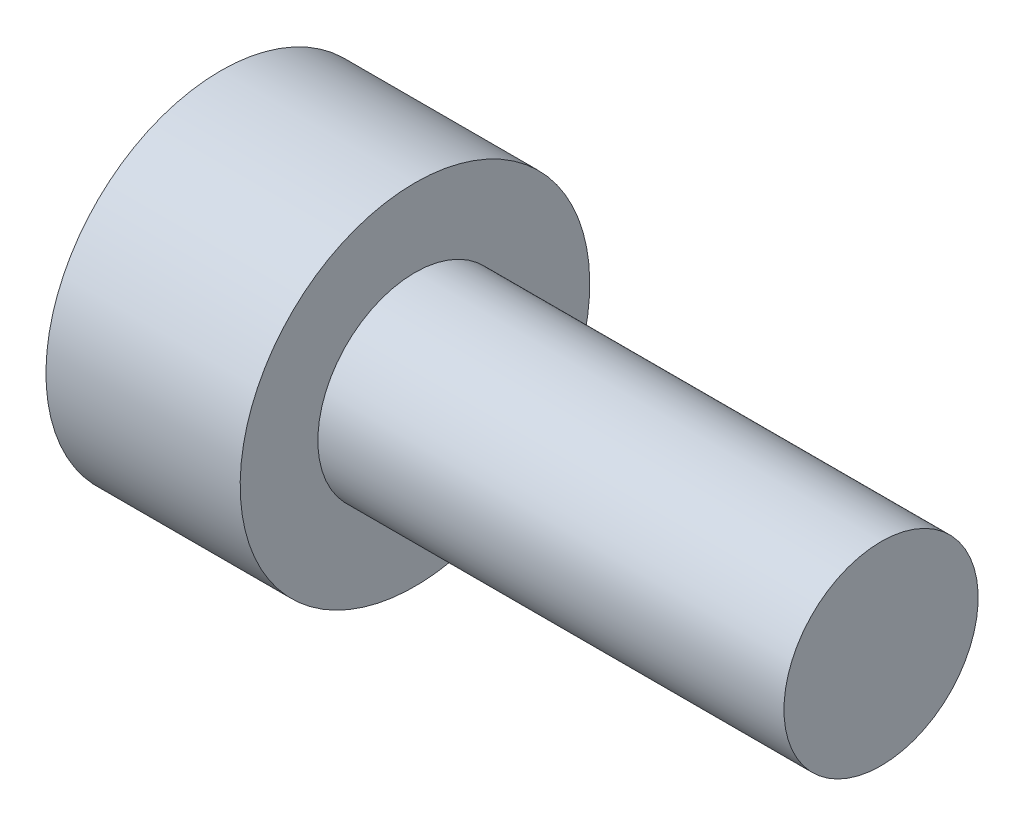
ISO-10303-21;
HEADER;
FILE_DESCRIPTION(('STEP AP214'),'2;1');
FILE_NAME('part.step','',(''),(''),'','','');
FILE_SCHEMA(('AUTOMOTIVE_DESIGN { 1 0 10303 214 1 1 1 1 }'));
ENDSEC;
DATA;
#1=APPLICATION_CONTEXT('core data for automotive mechanical design processes');
#2=APPLICATION_PROTOCOL_DEFINITION('international standard','automotive_design',2000,#1);
#3=PRODUCT_CONTEXT('',#1,'mechanical');
#4=PRODUCT('Part','Part','',(#3));
#5=PRODUCT_RELATED_PRODUCT_CATEGORY('part','',(#4));
#6=PRODUCT_DEFINITION_FORMATION('','',#4);
#7=PRODUCT_DEFINITION_CONTEXT('part definition',#1,'design');
#8=PRODUCT_DEFINITION('design','',#6,#7);
#9=PRODUCT_DEFINITION_SHAPE('','',#8);
#10=(LENGTH_UNIT() NAMED_UNIT(*) SI_UNIT(.MILLI.,.METRE.));
#11=(NAMED_UNIT(*) PLANE_ANGLE_UNIT() SI_UNIT($,.RADIAN.));
#12=(NAMED_UNIT(*) SI_UNIT($,.STERADIAN.) SOLID_ANGLE_UNIT());
#13=UNCERTAINTY_MEASURE_WITH_UNIT(LENGTH_MEASURE(1.E-05),#10,'distance_accuracy_value','');
#14=(GEOMETRIC_REPRESENTATION_CONTEXT(3) GLOBAL_UNCERTAINTY_ASSIGNED_CONTEXT((#13)) GLOBAL_UNIT_ASSIGNED_CONTEXT((#10,
#11,#12)) REPRESENTATION_CONTEXT('',''));
#15=CARTESIAN_POINT('',(0.,0.,0.));
#16=DIRECTION('',(0.,0.,1.));
#17=DIRECTION('',(1.,0.,0.));
#18=AXIS2_PLACEMENT_3D('',#15,#16,#17);
#19=CARTESIAN_POINT('',(0.,0.,0.));
#20=DIRECTION('',(-1.,0.,0.));
#21=DIRECTION('',(0.,-1.,0.));
#22=AXIS2_PLACEMENT_3D('',#19,#20,#21);
#23=PLANE('',#22);
#24=DIRECTION('',(0.,0.866025403784439,0.5));
#25=VECTOR('',#24,1.);
#26=CARTESIAN_POINT('',(0.,-1.,0.577350269189626));
#27=LINE('',#26,#25);
#28=CARTESIAN_POINT('',(0.,-1.,0.577350269189626));
#29=VERTEX_POINT('',#28);
#30=CARTESIAN_POINT('',(0.,0.,1.15470053837925));
#31=VERTEX_POINT('',#30);
#32=EDGE_CURVE('E47',#29,#31,#27,.T.);
#33=ORIENTED_EDGE('',*,*,#32,.F.);
#34=DIRECTION('',(0.,0.,1.));
#35=VECTOR('',#34,1.);
#36=CARTESIAN_POINT('',(0.,-1.,-0.577350269189626));
#37=LINE('',#36,#35);
#38=CARTESIAN_POINT('',(0.,-1.,-0.577350269189626));
#39=VERTEX_POINT('',#38);
#40=EDGE_CURVE('E130',#39,#29,#37,.T.);
#41=ORIENTED_EDGE('',*,*,#40,.F.);
#42=DIRECTION('',(0.,-0.866025403784439,0.5));
#43=VECTOR('',#42,1.);
#44=CARTESIAN_POINT('',(0.,0.,-1.15470053837925));
#45=LINE('',#44,#43);
#46=CARTESIAN_POINT('',(0.,0.,-1.15470053837925));
#47=VERTEX_POINT('',#46);
#48=EDGE_CURVE('E128',#47,#39,#45,.T.);
#49=ORIENTED_EDGE('',*,*,#48,.F.);
#50=DIRECTION('',(0.,-0.866025403784439,-0.5));
#51=VECTOR('',#50,1.);
#52=CARTESIAN_POINT('',(0.,1.,-0.577350269189626));
#53=LINE('',#52,#51);
#54=CARTESIAN_POINT('',(0.,1.,-0.577350269189626));
#55=VERTEX_POINT('',#54);
#56=EDGE_CURVE('E95',#55,#47,#53,.T.);
#57=ORIENTED_EDGE('',*,*,#56,.F.);
#58=DIRECTION('',(0.,0.,-1.));
#59=VECTOR('',#58,1.);
#60=CARTESIAN_POINT('',(0.,1.,0.577350269189625));
#61=LINE('',#60,#59);
#62=CARTESIAN_POINT('',(0.,1.,0.577350269189625));
#63=VERTEX_POINT('',#62);
#64=EDGE_CURVE('E124',#63,#55,#61,.T.);
#65=ORIENTED_EDGE('',*,*,#64,.F.);
#66=DIRECTION('',(0.,0.866025403784439,-0.5));
#67=VECTOR('',#66,1.);
#68=CARTESIAN_POINT('',(0.,0.,1.15470053837925));
#69=LINE('',#68,#67);
#70=EDGE_CURVE('E121',#31,#63,#69,.T.);
#71=ORIENTED_EDGE('',*,*,#70,.F.);
#72=EDGE_LOOP('',(#33,#41,#49,#57,#65,#71));
#73=FACE_BOUND('',#72,.T.);
#74=CARTESIAN_POINT('',(0.,0.,0.));
#75=DIRECTION('',(1.,0.,0.));
#76=DIRECTION('',(0.,1.,0.));
#77=AXIS2_PLACEMENT_3D('',#74,#75,#76);
#78=CIRCLE('',#77,2.25);
#79=CARTESIAN_POINT('',(0.,2.25,0.));
#80=VERTEX_POINT('',#79);
#81=EDGE_CURVE('E11',#80,#80,#78,.T.);
#82=ORIENTED_EDGE('',*,*,#81,.F.);
#83=EDGE_LOOP('',(#82));
#84=FACE_BOUND('',#83,.T.);
#85=ADVANCED_FACE('F33',(#73,#84),#23,.T.);
#86=CARTESIAN_POINT('',(8.5,0.,0.));
#87=DIRECTION('',(1.,0.,0.));
#88=DIRECTION('',(0.,1.,0.));
#89=AXIS2_PLACEMENT_3D('',#86,#87,#88);
#90=CYLINDRICAL_SURFACE('',#89,2.25);
#91=ORIENTED_EDGE('',*,*,#81,.T.);
#92=EDGE_LOOP('',(#91));
#93=FACE_BOUND('',#92,.T.);
#94=CARTESIAN_POINT('',(2.5,0.,0.));
#95=DIRECTION('',(1.,0.,0.));
#96=DIRECTION('',(0.,1.,0.));
#97=AXIS2_PLACEMENT_3D('',#94,#95,#96);
#98=CIRCLE('',#97,2.25);
#99=CARTESIAN_POINT('',(2.5,2.25,0.));
#100=VERTEX_POINT('',#99);
#101=EDGE_CURVE('E40',#100,#100,#98,.T.);
#102=ORIENTED_EDGE('',*,*,#101,.F.);
#103=EDGE_LOOP('',(#102));
#104=FACE_BOUND('',#103,.T.);
#105=ADVANCED_FACE('F150',(#93,#104),#90,.T.);
#106=CARTESIAN_POINT('',(2.5,2.25,0.));
#107=DIRECTION('',(1.,0.,0.));
#108=DIRECTION('',(0.,1.,0.));
#109=AXIS2_PLACEMENT_3D('',#106,#107,#108);
#110=PLANE('',#109);
#111=ORIENTED_EDGE('',*,*,#101,.T.);
#112=EDGE_LOOP('',(#111));
#113=FACE_BOUND('',#112,.T.);
#114=CARTESIAN_POINT('',(2.5,0.,0.));
#115=DIRECTION('',(1.,0.,0.));
#116=DIRECTION('',(0.,1.,0.));
#117=AXIS2_PLACEMENT_3D('',#114,#115,#116);
#118=CIRCLE('',#117,1.25);
#119=CARTESIAN_POINT('',(2.5,1.25,0.));
#120=VERTEX_POINT('',#119);
#121=EDGE_CURVE('E142',#120,#120,#118,.T.);
#122=ORIENTED_EDGE('',*,*,#121,.F.);
#123=EDGE_LOOP('',(#122));
#124=FACE_BOUND('',#123,.T.);
#125=ADVANCED_FACE('F147',(#113,#124),#110,.T.);
#126=CARTESIAN_POINT('',(8.5,0.,0.));
#127=DIRECTION('',(1.,0.,0.));
#128=DIRECTION('',(0.,1.,0.));
#129=AXIS2_PLACEMENT_3D('',#126,#127,#128);
#130=CYLINDRICAL_SURFACE('',#129,1.25);
#131=ORIENTED_EDGE('',*,*,#121,.T.);
#132=EDGE_LOOP('',(#131));
#133=FACE_BOUND('',#132,.T.);
#134=CARTESIAN_POINT('',(8.5,0.,0.));
#135=DIRECTION('',(1.,0.,0.));
#136=DIRECTION('',(0.,1.,0.));
#137=AXIS2_PLACEMENT_3D('',#134,#135,#136);
#138=CIRCLE('',#137,1.25);
#139=CARTESIAN_POINT('',(8.5,1.25,0.));
#140=VERTEX_POINT('',#139);
#141=EDGE_CURVE('E134',#140,#140,#138,.T.);
#142=ORIENTED_EDGE('',*,*,#141,.F.);
#143=EDGE_LOOP('',(#142));
#144=FACE_BOUND('',#143,.T.);
#145=ADVANCED_FACE('F157',(#133,#144),#130,.T.);
#146=CARTESIAN_POINT('',(8.5,1.25,0.));
#147=DIRECTION('',(1.,0.,0.));
#148=DIRECTION('',(0.,1.,0.));
#149=AXIS2_PLACEMENT_3D('',#146,#147,#148);
#150=PLANE('',#149);
#151=ORIENTED_EDGE('',*,*,#141,.T.);
#152=EDGE_LOOP('',(#151));
#153=FACE_BOUND('',#152,.T.);
#154=ADVANCED_FACE('F163',(#153),#150,.T.);
#155=CARTESIAN_POINT('',(1.5,-1.,0.577350269189626));
#156=DIRECTION('',(0.,-0.5,0.866025403784439));
#157=DIRECTION('',(0.,-0.866025403784439,-0.5));
#158=AXIS2_PLACEMENT_3D('',#155,#156,#157);
#159=PLANE('',#158);
#160=ORIENTED_EDGE('',*,*,#32,.T.);
#161=DIRECTION('',(-1.,0.,0.));
#162=VECTOR('',#161,1.);
#163=CARTESIAN_POINT('',(1.5,0.,1.15470053837925));
#164=LINE('',#163,#162);
#165=CARTESIAN_POINT('',(1.5,0.,1.15470053837925));
#166=VERTEX_POINT('',#165);
#167=EDGE_CURVE('E77',#166,#31,#164,.T.);
#168=ORIENTED_EDGE('',*,*,#167,.F.);
#169=DIRECTION('',(0.,0.866025403784439,0.5));
#170=VECTOR('',#169,1.);
#171=CARTESIAN_POINT('',(1.5,-1.,0.577350269189626));
#172=LINE('',#171,#170);
#173=CARTESIAN_POINT('',(1.5,-1.,0.577350269189626));
#174=VERTEX_POINT('',#173);
#175=EDGE_CURVE('E132',#174,#166,#172,.T.);
#176=ORIENTED_EDGE('',*,*,#175,.F.);
#177=DIRECTION('',(-1.,0.,0.));
#178=VECTOR('',#177,1.);
#179=CARTESIAN_POINT('',(1.5,-1.,0.577350269189626));
#180=LINE('',#179,#178);
#181=EDGE_CURVE('E55',#174,#29,#180,.T.);
#182=ORIENTED_EDGE('',*,*,#181,.T.);
#183=EDGE_LOOP('',(#160,#168,#176,#182));
#184=FACE_BOUND('',#183,.T.);
#185=ADVANCED_FACE('F167',(#184),#159,.F.);
#186=CARTESIAN_POINT('',(1.5,-1.,-0.577350269189626));
#187=DIRECTION('',(0.,-1.,0.));
#188=DIRECTION('',(0.,0.,-1.));
#189=AXIS2_PLACEMENT_3D('',#186,#187,#188);
#190=PLANE('',#189);
#191=ORIENTED_EDGE('',*,*,#40,.T.);
#192=ORIENTED_EDGE('',*,*,#181,.F.);
#193=DIRECTION('',(0.,0.,1.));
#194=VECTOR('',#193,1.);
#195=CARTESIAN_POINT('',(1.5,-1.,-0.577350269189626));
#196=LINE('',#195,#194);
#197=CARTESIAN_POINT('',(1.5,-1.,-0.577350269189626));
#198=VERTEX_POINT('',#197);
#199=EDGE_CURVE('E107',#198,#174,#196,.T.);
#200=ORIENTED_EDGE('',*,*,#199,.F.);
#201=DIRECTION('',(-1.,0.,0.));
#202=VECTOR('',#201,1.);
#203=CARTESIAN_POINT('',(1.5,-1.,-0.577350269189626));
#204=LINE('',#203,#202);
#205=EDGE_CURVE('E99',#198,#39,#204,.T.);
#206=ORIENTED_EDGE('',*,*,#205,.T.);
#207=EDGE_LOOP('',(#191,#192,#200,#206));
#208=FACE_BOUND('',#207,.T.);
#209=ADVANCED_FACE('F171',(#208),#190,.F.);
#210=CARTESIAN_POINT('',(1.5,0.,-1.15470053837925));
#211=DIRECTION('',(0.,-0.5,-0.866025403784439));
#212=DIRECTION('',(0.,0.866025403784439,-0.5));
#213=AXIS2_PLACEMENT_3D('',#210,#211,#212);
#214=PLANE('',#213);
#215=ORIENTED_EDGE('',*,*,#48,.T.);
#216=ORIENTED_EDGE('',*,*,#205,.F.);
#217=DIRECTION('',(0.,-0.866025403784439,0.5));
#218=VECTOR('',#217,1.);
#219=CARTESIAN_POINT('',(1.5,0.,-1.15470053837925));
#220=LINE('',#219,#218);
#221=CARTESIAN_POINT('',(1.5,0.,-1.15470053837925));
#222=VERTEX_POINT('',#221);
#223=EDGE_CURVE('E103',#222,#198,#220,.T.);
#224=ORIENTED_EDGE('',*,*,#223,.F.);
#225=DIRECTION('',(-1.,0.,0.));
#226=VECTOR('',#225,1.);
#227=CARTESIAN_POINT('',(1.5,0.,-1.15470053837925));
#228=LINE('',#227,#226);
#229=EDGE_CURVE('E88',#222,#47,#228,.T.);
#230=ORIENTED_EDGE('',*,*,#229,.T.);
#231=EDGE_LOOP('',(#215,#216,#224,#230));
#232=FACE_BOUND('',#231,.T.);
#233=ADVANCED_FACE('F104',(#232),#214,.F.);
#234=CARTESIAN_POINT('',(1.5,1.,-0.577350269189626));
#235=DIRECTION('',(0.,0.5,-0.866025403784439));
#236=DIRECTION('',(0.,0.866025403784439,0.5));
#237=AXIS2_PLACEMENT_3D('',#234,#235,#236);
#238=PLANE('',#237);
#239=ORIENTED_EDGE('',*,*,#56,.T.);
#240=ORIENTED_EDGE('',*,*,#229,.F.);
#241=DIRECTION('',(0.,-0.866025403784439,-0.5));
#242=VECTOR('',#241,1.);
#243=CARTESIAN_POINT('',(1.5,1.,-0.577350269189626));
#244=LINE('',#243,#242);
#245=CARTESIAN_POINT('',(1.5,1.,-0.577350269189626));
#246=VERTEX_POINT('',#245);
#247=EDGE_CURVE('E92',#246,#222,#244,.T.);
#248=ORIENTED_EDGE('',*,*,#247,.F.);
#249=DIRECTION('',(-1.,0.,0.));
#250=VECTOR('',#249,1.);
#251=CARTESIAN_POINT('',(1.5,1.,-0.577350269189626));
#252=LINE('',#251,#250);
#253=EDGE_CURVE('E100',#246,#55,#252,.T.);
#254=ORIENTED_EDGE('',*,*,#253,.T.);
#255=EDGE_LOOP('',(#239,#240,#248,#254));
#256=FACE_BOUND('',#255,.T.);
#257=ADVANCED_FACE('F90',(#256),#238,.F.);
#258=CARTESIAN_POINT('',(1.5,1.,0.577350269189625));
#259=DIRECTION('',(0.,1.,0.));
#260=DIRECTION('',(-1.,0.,0.));
#261=AXIS2_PLACEMENT_3D('',#258,#259,#260);
#262=PLANE('',#261);
#263=ORIENTED_EDGE('',*,*,#64,.T.);
#264=ORIENTED_EDGE('',*,*,#253,.F.);
#265=DIRECTION('',(0.,0.,-1.));
#266=VECTOR('',#265,1.);
#267=CARTESIAN_POINT('',(1.5,1.,0.577350269189625));
#268=LINE('',#267,#266);
#269=CARTESIAN_POINT('',(1.5,1.,0.577350269189625));
#270=VERTEX_POINT('',#269);
#271=EDGE_CURVE('E113',#270,#246,#268,.T.);
#272=ORIENTED_EDGE('',*,*,#271,.F.);
#273=DIRECTION('',(-1.,0.,0.));
#274=VECTOR('',#273,1.);
#275=CARTESIAN_POINT('',(1.5,1.,0.577350269189625));
#276=LINE('',#275,#274);
#277=EDGE_CURVE('E137',#270,#63,#276,.T.);
#278=ORIENTED_EDGE('',*,*,#277,.T.);
#279=EDGE_LOOP('',(#263,#264,#272,#278));
#280=FACE_BOUND('',#279,.T.);
#281=ADVANCED_FACE('F175',(#280),#262,.F.);
#282=CARTESIAN_POINT('',(1.5,0.,1.15470053837925));
#283=DIRECTION('',(0.,0.5,0.866025403784439));
#284=DIRECTION('',(0.,-0.866025403784439,0.5));
#285=AXIS2_PLACEMENT_3D('',#282,#283,#284);
#286=PLANE('',#285);
#287=ORIENTED_EDGE('',*,*,#70,.T.);
#288=ORIENTED_EDGE('',*,*,#277,.F.);
#289=DIRECTION('',(0.,0.866025403784439,-0.5));
#290=VECTOR('',#289,1.);
#291=CARTESIAN_POINT('',(1.5,0.,1.15470053837925));
#292=LINE('',#291,#290);
#293=EDGE_CURVE('E115',#166,#270,#292,.T.);
#294=ORIENTED_EDGE('',*,*,#293,.F.);
#295=ORIENTED_EDGE('',*,*,#167,.T.);
#296=EDGE_LOOP('',(#287,#288,#294,#295));
#297=FACE_BOUND('',#296,.T.);
#298=ADVANCED_FACE('F172',(#297),#286,.F.);
#299=CARTESIAN_POINT('',(1.5,0.,0.));
#300=DIRECTION('',(-1.,0.,0.));
#301=DIRECTION('',(0.,-1.,0.));
#302=AXIS2_PLACEMENT_3D('',#299,#300,#301);
#303=PLANE('',#302);
#304=ORIENTED_EDGE('',*,*,#175,.T.);
#305=ORIENTED_EDGE('',*,*,#293,.T.);
#306=ORIENTED_EDGE('',*,*,#271,.T.);
#307=ORIENTED_EDGE('',*,*,#247,.T.);
#308=ORIENTED_EDGE('',*,*,#223,.T.);
#309=ORIENTED_EDGE('',*,*,#199,.T.);
#310=EDGE_LOOP('',(#304,#305,#306,#307,#308,#309));
#311=FACE_BOUND('',#310,.T.);
#312=ADVANCED_FACE('F110',(#311),#303,.T.);
#313=CLOSED_SHELL('',(#85,#105,#125,#145,#154,#185,#209,#233,#257,#281,#298,#312));
#314=MANIFOLD_SOLID_BREP('B2',#313);
#315=ADVANCED_BREP_SHAPE_REPRESENTATION('',(#18,#314),#14);
#316=SHAPE_DEFINITION_REPRESENTATION(#9,#315);
ENDSEC;
END-ISO-10303-21;
